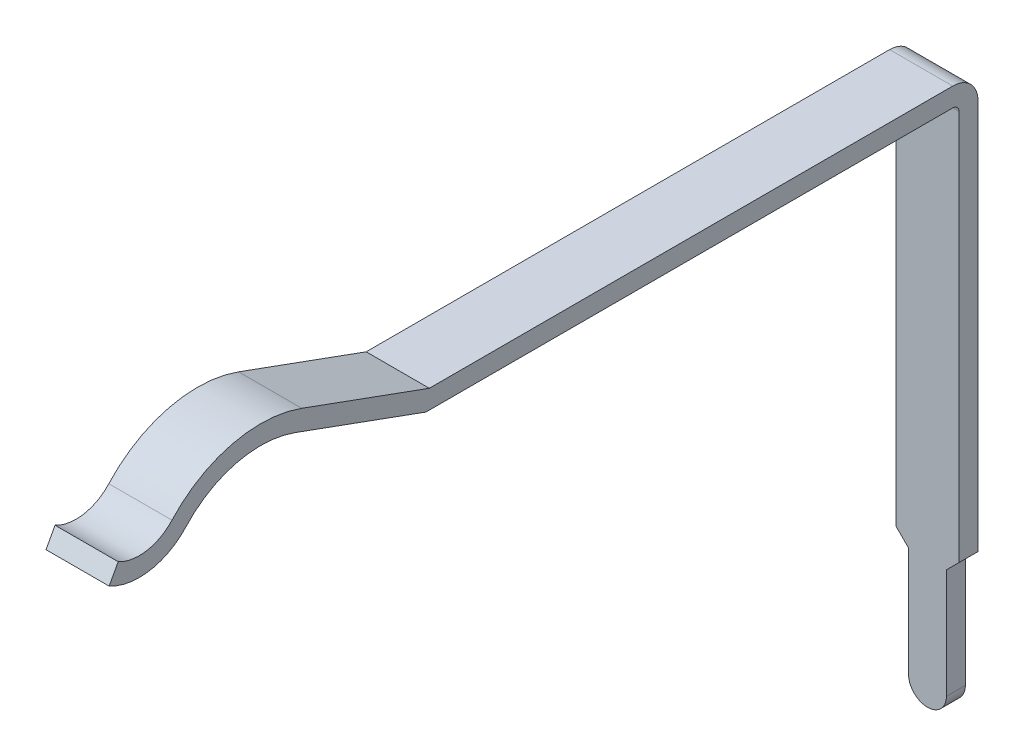
ISO-10303-21;
HEADER;
FILE_DESCRIPTION(('STEP AP214'),'2;1');
FILE_NAME('part.step','',(''),(''),'','','');
FILE_SCHEMA(('AUTOMOTIVE_DESIGN { 1 0 10303 214 1 1 1 1 }'));
ENDSEC;
DATA;
#1=APPLICATION_CONTEXT('core data for automotive mechanical design processes');
#2=APPLICATION_PROTOCOL_DEFINITION('international standard','automotive_design',2000,#1);
#3=PRODUCT_CONTEXT('',#1,'mechanical');
#4=PRODUCT('Part','Part','',(#3));
#5=PRODUCT_RELATED_PRODUCT_CATEGORY('part','',(#4));
#6=PRODUCT_DEFINITION_FORMATION('','',#4);
#7=PRODUCT_DEFINITION_CONTEXT('part definition',#1,'design');
#8=PRODUCT_DEFINITION('design','',#6,#7);
#9=PRODUCT_DEFINITION_SHAPE('','',#8);
#10=(LENGTH_UNIT() NAMED_UNIT(*) SI_UNIT(.MILLI.,.METRE.));
#11=(NAMED_UNIT(*) PLANE_ANGLE_UNIT() SI_UNIT($,.RADIAN.));
#12=(NAMED_UNIT(*) SI_UNIT($,.STERADIAN.) SOLID_ANGLE_UNIT());
#13=UNCERTAINTY_MEASURE_WITH_UNIT(LENGTH_MEASURE(1.E-05),#10,'distance_accuracy_value','');
#14=(GEOMETRIC_REPRESENTATION_CONTEXT(3) GLOBAL_UNCERTAINTY_ASSIGNED_CONTEXT((#13)) GLOBAL_UNIT_ASSIGNED_CONTEXT((#10,
#11,#12)) REPRESENTATION_CONTEXT('',''));
#15=CARTESIAN_POINT('',(0.,0.,0.));
#16=DIRECTION('',(0.,0.,1.));
#17=DIRECTION('',(1.,0.,0.));
#18=AXIS2_PLACEMENT_3D('',#15,#16,#17);
#19=CARTESIAN_POINT('',(0.5,-0.1,-14.46));
#20=DIRECTION('',(0.,0.,-1.));
#21=DIRECTION('',(-1.,0.,0.));
#22=AXIS2_PLACEMENT_3D('',#19,#20,#21);
#23=PLANE('',#22);
#24=DIRECTION('',(0.,1.,0.));
#25=VECTOR('',#24,1.);
#26=CARTESIAN_POINT('',(0.3,-0.1,-14.46));
#27=LINE('',#26,#25);
#28=CARTESIAN_POINT('',(0.3,-8.22,-14.46));
#29=VERTEX_POINT('',#28);
#30=CARTESIAN_POINT('',(0.3,-6.48526500902805,-14.46));
#31=VERTEX_POINT('',#30);
#32=EDGE_CURVE('E259',#29,#31,#27,.T.);
#33=ORIENTED_EDGE('',*,*,#32,.T.);
#34=DIRECTION('',(0.707106781186563,0.707106781186532,0.));
#35=VECTOR('',#34,1.);
#36=CARTESIAN_POINT('',(3.59263250451403,-3.19263250451417,-14.46));
#37=LINE('',#36,#35);
#38=CARTESIAN_POINT('',(0.5,-6.28526500902806,-14.46));
#39=VERTEX_POINT('',#38);
#40=EDGE_CURVE('E254',#31,#39,#37,.T.);
#41=ORIENTED_EDGE('',*,*,#40,.T.);
#42=DIRECTION('',(0.,-1.,0.));
#43=VECTOR('',#42,1.);
#44=CARTESIAN_POINT('',(0.5,-0.1,-14.46));
#45=LINE('',#44,#43);
#46=CARTESIAN_POINT('',(0.5,-0.1,-14.46));
#47=VERTEX_POINT('',#46);
#48=EDGE_CURVE('E182',#47,#39,#45,.T.);
#49=ORIENTED_EDGE('',*,*,#48,.F.);
#50=DIRECTION('',(-1.,0.,0.));
#51=VECTOR('',#50,1.);
#52=CARTESIAN_POINT('',(0.5,-0.1,-14.46));
#53=LINE('',#52,#51);
#54=CARTESIAN_POINT('',(-0.5,-0.1,-14.46));
#55=VERTEX_POINT('',#54);
#56=EDGE_CURVE('E145',#47,#55,#53,.T.);
#57=ORIENTED_EDGE('',*,*,#56,.T.);
#58=DIRECTION('',(0.,-1.,0.));
#59=VECTOR('',#58,1.);
#60=CARTESIAN_POINT('',(-0.5,-0.1,-14.46));
#61=LINE('',#60,#59);
#62=CARTESIAN_POINT('',(-0.5,-6.28526500902805,-14.46));
#63=VERTEX_POINT('',#62);
#64=EDGE_CURVE('E149',#55,#63,#61,.T.);
#65=ORIENTED_EDGE('',*,*,#64,.T.);
#66=DIRECTION('',(0.707106781186542,-0.707106781186553,0.));
#67=VECTOR('',#66,1.);
#68=CARTESIAN_POINT('',(-3.09263250451403,-3.69263250451398,-14.46));
#69=LINE('',#68,#67);
#70=CARTESIAN_POINT('',(-0.3,-6.48526500902805,-14.46));
#71=VERTEX_POINT('',#70);
#72=EDGE_CURVE('E31',#63,#71,#69,.T.);
#73=ORIENTED_EDGE('',*,*,#72,.T.);
#74=DIRECTION('',(0.,-1.,0.));
#75=VECTOR('',#74,1.);
#76=CARTESIAN_POINT('',(-0.3,-0.1,-14.46));
#77=LINE('',#76,#75);
#78=CARTESIAN_POINT('',(-0.3,-8.22,-14.46));
#79=VERTEX_POINT('',#78);
#80=EDGE_CURVE('E261',#71,#79,#77,.T.);
#81=ORIENTED_EDGE('',*,*,#80,.T.);
#82=CARTESIAN_POINT('',(0.,-8.22,-14.46));
#83=DIRECTION('',(0.,0.,-1.));
#84=DIRECTION('',(-1.,0.,0.));
#85=AXIS2_PLACEMENT_3D('',#82,#83,#84);
#86=CIRCLE('',#85,0.3);
#87=EDGE_CURVE('E153',#79,#29,#86,.F.);
#88=ORIENTED_EDGE('',*,*,#87,.T.);
#89=EDGE_LOOP('',(#33,#41,#49,#57,#65,#73,#81,#88));
#90=FACE_BOUND('',#89,.T.);
#91=ADVANCED_FACE('F17',(#90),#23,.F.);
#92=CARTESIAN_POINT('',(0.5,-0.1,-14.76));
#93=DIRECTION('',(0.,0.,-1.));
#94=DIRECTION('',(-1.,0.,0.));
#95=AXIS2_PLACEMENT_3D('',#92,#93,#94);
#96=PLANE('',#95);
#97=DIRECTION('',(-0.707106781186563,-0.707106781186532,0.));
#98=VECTOR('',#97,1.);
#99=CARTESIAN_POINT('',(0.5,-6.28526500902806,-14.76));
#100=LINE('',#99,#98);
#101=CARTESIAN_POINT('',(0.5,-6.28526500902806,-14.76));
#102=VERTEX_POINT('',#101);
#103=CARTESIAN_POINT('',(0.3,-6.48526500902805,-14.76));
#104=VERTEX_POINT('',#103);
#105=EDGE_CURVE('E285',#102,#104,#100,.T.);
#106=ORIENTED_EDGE('',*,*,#105,.T.);
#107=DIRECTION('',(0.,-1.,0.));
#108=VECTOR('',#107,1.);
#109=CARTESIAN_POINT('',(0.3,-6.48526500902805,-14.76));
#110=LINE('',#109,#108);
#111=CARTESIAN_POINT('',(0.3,-8.22,-14.76));
#112=VERTEX_POINT('',#111);
#113=EDGE_CURVE('E271',#104,#112,#110,.T.);
#114=ORIENTED_EDGE('',*,*,#113,.T.);
#115=CARTESIAN_POINT('',(0.,-8.22,-14.76));
#116=DIRECTION('',(0.,0.,-1.));
#117=DIRECTION('',(1.,0.,0.));
#118=AXIS2_PLACEMENT_3D('',#115,#116,#117);
#119=CIRCLE('',#118,0.3);
#120=CARTESIAN_POINT('',(-0.3,-8.22,-14.76));
#121=VERTEX_POINT('',#120);
#122=EDGE_CURVE('E294',#112,#121,#119,.T.);
#123=ORIENTED_EDGE('',*,*,#122,.T.);
#124=DIRECTION('',(0.,1.,0.));
#125=VECTOR('',#124,1.);
#126=CARTESIAN_POINT('',(-0.3,-8.22,-14.76));
#127=LINE('',#126,#125);
#128=CARTESIAN_POINT('',(-0.3,-6.48526500902805,-14.76));
#129=VERTEX_POINT('',#128);
#130=EDGE_CURVE('E291',#121,#129,#127,.T.);
#131=ORIENTED_EDGE('',*,*,#130,.T.);
#132=DIRECTION('',(-0.707106781186542,0.707106781186553,0.));
#133=VECTOR('',#132,1.);
#134=CARTESIAN_POINT('',(-0.3,-6.48526500902805,-14.76));
#135=LINE('',#134,#133);
#136=CARTESIAN_POINT('',(-0.5,-6.28526500902805,-14.76));
#137=VERTEX_POINT('',#136);
#138=EDGE_CURVE('E288',#129,#137,#135,.T.);
#139=ORIENTED_EDGE('',*,*,#138,.T.);
#140=DIRECTION('',(0.,1.,0.));
#141=VECTOR('',#140,1.);
#142=CARTESIAN_POINT('',(-0.5,-0.1,-14.76));
#143=LINE('',#142,#141);
#144=CARTESIAN_POINT('',(-0.5,-0.1,-14.76));
#145=VERTEX_POINT('',#144);
#146=EDGE_CURVE('E152',#145,#137,#143,.F.);
#147=ORIENTED_EDGE('',*,*,#146,.F.);
#148=DIRECTION('',(-1.,0.,0.));
#149=VECTOR('',#148,1.);
#150=CARTESIAN_POINT('',(0.5,-0.1,-14.76));
#151=LINE('',#150,#149);
#152=CARTESIAN_POINT('',(0.5,-0.1,-14.76));
#153=VERTEX_POINT('',#152);
#154=EDGE_CURVE('E11',#153,#145,#151,.T.);
#155=ORIENTED_EDGE('',*,*,#154,.F.);
#156=DIRECTION('',(0.,1.,0.));
#157=VECTOR('',#156,1.);
#158=CARTESIAN_POINT('',(0.5,-0.1,-14.76));
#159=LINE('',#158,#157);
#160=EDGE_CURVE('E224',#153,#102,#159,.F.);
#161=ORIENTED_EDGE('',*,*,#160,.T.);
#162=EDGE_LOOP('',(#106,#114,#123,#131,#139,#147,#155,#161));
#163=FACE_BOUND('',#162,.T.);
#164=ADVANCED_FACE('F298',(#163),#96,.T.);
#165=CARTESIAN_POINT('',(0.5,-0.1,-14.36));
#166=DIRECTION('',(-1.,0.,0.));
#167=DIRECTION('',(0.,0.,1.));
#168=AXIS2_PLACEMENT_3D('',#165,#166,#167);
#169=CYLINDRICAL_SURFACE('',#168,0.4);
#170=CARTESIAN_POINT('',(-0.5,-0.1,-14.36));
#171=DIRECTION('',(1.,0.,0.));
#172=DIRECTION('',(0.,0.,-1.));
#173=AXIS2_PLACEMENT_3D('',#170,#171,#172);
#174=CIRCLE('',#173,0.4);
#175=CARTESIAN_POINT('',(-0.5,0.3,-14.36));
#176=VERTEX_POINT('',#175);
#177=EDGE_CURVE('E156',#176,#145,#174,.F.);
#178=ORIENTED_EDGE('',*,*,#177,.F.);
#179=DIRECTION('',(-1.,0.,0.));
#180=VECTOR('',#179,1.);
#181=CARTESIAN_POINT('',(0.5,0.3,-14.36));
#182=LINE('',#181,#180);
#183=CARTESIAN_POINT('',(0.5,0.3,-14.36));
#184=VERTEX_POINT('',#183);
#185=EDGE_CURVE('E24',#184,#176,#182,.T.);
#186=ORIENTED_EDGE('',*,*,#185,.F.);
#187=CARTESIAN_POINT('',(0.5,-0.1,-14.36));
#188=DIRECTION('',(1.,0.,0.));
#189=DIRECTION('',(0.,0.,-1.));
#190=AXIS2_PLACEMENT_3D('',#187,#188,#189);
#191=CIRCLE('',#190,0.4);
#192=EDGE_CURVE('E220',#184,#153,#191,.F.);
#193=ORIENTED_EDGE('',*,*,#192,.T.);
#194=ORIENTED_EDGE('',*,*,#154,.T.);
#195=EDGE_LOOP('',(#178,#186,#193,#194));
#196=FACE_BOUND('',#195,.T.);
#197=ADVANCED_FACE('F208',(#196),#169,.T.);
#198=CARTESIAN_POINT('',(0.5,0.3,-6.01747897567001));
#199=DIRECTION('',(0.,1.,0.));
#200=DIRECTION('',(0.,0.,1.));
#201=AXIS2_PLACEMENT_3D('',#198,#199,#200);
#202=PLANE('',#201);
#203=DIRECTION('',(0.,0.,-1.));
#204=VECTOR('',#203,1.);
#205=CARTESIAN_POINT('',(-0.5,0.3,-6.01747897567001));
#206=LINE('',#205,#204);
#207=CARTESIAN_POINT('',(-0.5,0.3,-6.07037706988255));
#208=VERTEX_POINT('',#207);
#209=EDGE_CURVE('E159',#208,#176,#206,.T.);
#210=ORIENTED_EDGE('',*,*,#209,.F.);
#211=DIRECTION('',(-1.,0.,0.));
#212=VECTOR('',#211,1.);
#213=CARTESIAN_POINT('',(0.5,0.3,-6.07037706988255));
#214=LINE('',#213,#212);
#215=CARTESIAN_POINT('',(0.5,0.3,-6.07037706988255));
#216=VERTEX_POINT('',#215);
#217=EDGE_CURVE('E197',#216,#208,#214,.T.);
#218=ORIENTED_EDGE('',*,*,#217,.F.);
#219=DIRECTION('',(0.,0.,-1.));
#220=VECTOR('',#219,1.);
#221=CARTESIAN_POINT('',(0.5,0.3,-6.01747897567001));
#222=LINE('',#221,#220);
#223=EDGE_CURVE('E204',#216,#184,#222,.T.);
#224=ORIENTED_EDGE('',*,*,#223,.T.);
#225=ORIENTED_EDGE('',*,*,#185,.T.);
#226=EDGE_LOOP('',(#210,#218,#224,#225));
#227=FACE_BOUND('',#226,.T.);
#228=ADVANCED_FACE('F202',(#227),#202,.T.);
#229=CARTESIAN_POINT('',(0.5,1.03541597949323,-4.04983827231876));
#230=DIRECTION('',(0.,0.93969262078591,-0.342020143325663));
#231=DIRECTION('',(0.,0.342020143325663,0.93969262078591));
#232=AXIS2_PLACEMENT_3D('',#229,#230,#231);
#233=PLANE('',#232);
#234=DIRECTION('',(0.,-0.342020143325663,-0.93969262078591));
#235=VECTOR('',#234,1.);
#236=CARTESIAN_POINT('',(-0.5,1.03541597949323,-4.04983827231876));
#237=LINE('',#236,#235);
#238=CARTESIAN_POINT('',(-0.5,1.03541597949323,-4.04983827231876));
#239=VERTEX_POINT('',#238);
#240=EDGE_CURVE('E162',#239,#208,#237,.T.);
#241=ORIENTED_EDGE('',*,*,#240,.F.);
#242=DIRECTION('',(-1.,0.,0.));
#243=VECTOR('',#242,1.);
#244=CARTESIAN_POINT('',(0.5,1.03541597949323,-4.04983827231876));
#245=LINE('',#244,#243);
#246=CARTESIAN_POINT('',(0.5,1.03541597949323,-4.04983827231876));
#247=VERTEX_POINT('',#246);
#248=EDGE_CURVE('E195',#247,#239,#245,.T.);
#249=ORIENTED_EDGE('',*,*,#248,.F.);
#250=DIRECTION('',(0.,-0.342020143325663,-0.93969262078591));
#251=VECTOR('',#250,1.);
#252=CARTESIAN_POINT('',(0.5,1.03541597949323,-4.04983827231876));
#253=LINE('',#252,#251);
#254=EDGE_CURVE('E217',#247,#216,#253,.T.);
#255=ORIENTED_EDGE('',*,*,#254,.T.);
#256=ORIENTED_EDGE('',*,*,#217,.T.);
#257=EDGE_LOOP('',(#241,#249,#255,#256));
#258=FACE_BOUND('',#257,.T.);
#259=ADVANCED_FACE('F214',(#258),#233,.T.);
#260=CARTESIAN_POINT('',(0.5,-0.75,-3.4));
#261=DIRECTION('',(-1.,0.,0.));
#262=DIRECTION('',(0.,0.,1.));
#263=AXIS2_PLACEMENT_3D('',#260,#261,#262);
#264=CYLINDRICAL_SURFACE('',#263,1.9);
#265=CARTESIAN_POINT('',(-0.5,-0.75,-3.4));
#266=DIRECTION('',(1.,0.,0.));
#267=DIRECTION('',(0.,0.,-1.));
#268=AXIS2_PLACEMENT_3D('',#265,#266,#267);
#269=CIRCLE('',#268,1.9);
#270=CARTESIAN_POINT('',(-0.5,0.528846153846154,-1.99481228485554));
#271=VERTEX_POINT('',#270);
#272=EDGE_CURVE('E165',#271,#239,#269,.F.);
#273=ORIENTED_EDGE('',*,*,#272,.F.);
#274=DIRECTION('',(-1.,0.,0.));
#275=VECTOR('',#274,1.);
#276=CARTESIAN_POINT('',(0.5,0.528846153846154,-1.99481228485554));
#277=LINE('',#276,#275);
#278=CARTESIAN_POINT('',(0.5,0.528846153846154,-1.99481228485554));
#279=VERTEX_POINT('',#278);
#280=EDGE_CURVE('E193',#279,#271,#277,.T.);
#281=ORIENTED_EDGE('',*,*,#280,.F.);
#282=CARTESIAN_POINT('',(0.5,-0.75,-3.4));
#283=DIRECTION('',(1.,0.,0.));
#284=DIRECTION('',(0.,0.,-1.));
#285=AXIS2_PLACEMENT_3D('',#282,#283,#284);
#286=CIRCLE('',#285,1.9);
#287=EDGE_CURVE('E222',#279,#247,#286,.F.);
#288=ORIENTED_EDGE('',*,*,#287,.T.);
#289=ORIENTED_EDGE('',*,*,#248,.T.);
#290=EDGE_LOOP('',(#273,#281,#288,#289));
#291=FACE_BOUND('',#290,.T.);
#292=ADVANCED_FACE('F357',(#291),#264,.T.);
#293=CARTESIAN_POINT('',(0.5,1.,-1.47711154769706));
#294=DIRECTION('',(-1.,0.,0.));
#295=DIRECTION('',(0.,0.,1.));
#296=AXIS2_PLACEMENT_3D('',#293,#294,#295);
#297=CYLINDRICAL_SURFACE('',#296,0.7);
#298=CARTESIAN_POINT('',(-0.5,1.,-1.47711154769706));
#299=DIRECTION('',(1.,0.,0.));
#300=DIRECTION('',(0.,0.,-1.));
#301=AXIS2_PLACEMENT_3D('',#298,#299,#300);
#302=CIRCLE('',#301,0.7);
#303=CARTESIAN_POINT('',(-0.5,0.384810078255083,-1.14313346430912));
#304=VERTEX_POINT('',#303);
#305=EDGE_CURVE('E168',#304,#271,#302,.T.);
#306=ORIENTED_EDGE('',*,*,#305,.F.);
#307=DIRECTION('',(-1.,0.,0.));
#308=VECTOR('',#307,1.);
#309=CARTESIAN_POINT('',(0.5,0.384810078255083,-1.14313346430912));
#310=LINE('',#309,#308);
#311=CARTESIAN_POINT('',(0.5,0.384810078255083,-1.14313346430912));
#312=VERTEX_POINT('',#311);
#313=EDGE_CURVE('E191',#312,#304,#310,.T.);
#314=ORIENTED_EDGE('',*,*,#313,.F.);
#315=CARTESIAN_POINT('',(0.5,1.,-1.47711154769706));
#316=DIRECTION('',(1.,0.,0.));
#317=DIRECTION('',(0.,0.,-1.));
#318=AXIS2_PLACEMENT_3D('',#315,#316,#317);
#319=CIRCLE('',#318,0.7);
#320=EDGE_CURVE('E229',#312,#279,#319,.T.);
#321=ORIENTED_EDGE('',*,*,#320,.T.);
#322=ORIENTED_EDGE('',*,*,#280,.T.);
#323=EDGE_LOOP('',(#306,#314,#321,#322));
#324=FACE_BOUND('',#323,.T.);
#325=ADVANCED_FACE('F360',(#324),#297,.F.);
#326=CARTESIAN_POINT('',(0.5,0.121157254650118,-1.));
#327=DIRECTION('',(0.,0.477111547697058,0.878842745349882));
#328=DIRECTION('',(0.,-0.878842745349883,0.477111547697058));
#329=AXIS2_PLACEMENT_3D('',#326,#327,#328);
#330=PLANE('',#329);
#331=DIRECTION('',(0.,0.878842745349882,-0.477111547697058));
#332=VECTOR('',#331,1.);
#333=CARTESIAN_POINT('',(-0.5,0.121157254650118,-1.));
#334=LINE('',#333,#332);
#335=CARTESIAN_POINT('',(-0.5,0.121157254650118,-1.));
#336=VERTEX_POINT('',#335);
#337=EDGE_CURVE('E171',#336,#304,#334,.T.);
#338=ORIENTED_EDGE('',*,*,#337,.F.);
#339=DIRECTION('',(-1.,0.,0.));
#340=VECTOR('',#339,1.);
#341=CARTESIAN_POINT('',(0.5,0.121157254650118,-1.));
#342=LINE('',#341,#340);
#343=CARTESIAN_POINT('',(0.5,0.121157254650118,-1.));
#344=VERTEX_POINT('',#343);
#345=EDGE_CURVE('E189',#344,#336,#342,.T.);
#346=ORIENTED_EDGE('',*,*,#345,.F.);
#347=DIRECTION('',(0.,0.878842745349882,-0.477111547697058));
#348=VECTOR('',#347,1.);
#349=CARTESIAN_POINT('',(0.5,0.121157254650118,-1.));
#350=LINE('',#349,#348);
#351=EDGE_CURVE('E232',#344,#312,#350,.T.);
#352=ORIENTED_EDGE('',*,*,#351,.T.);
#353=ORIENTED_EDGE('',*,*,#313,.T.);
#354=EDGE_LOOP('',(#338,#346,#352,#353));
#355=FACE_BOUND('',#354,.T.);
#356=ADVANCED_FACE('F364',(#355),#330,.T.);
#357=CARTESIAN_POINT('',(0.5,1.,-1.47711154769706));
#358=DIRECTION('',(-1.,0.,0.));
#359=DIRECTION('',(0.,0.,1.));
#360=AXIS2_PLACEMENT_3D('',#357,#358,#359);
#361=CYLINDRICAL_SURFACE('',#360,1.);
#362=CARTESIAN_POINT('',(-0.5,1.,-1.47711154769706));
#363=DIRECTION('',(1.,0.,0.));
#364=DIRECTION('',(0.,0.,1.));
#365=AXIS2_PLACEMENT_3D('',#362,#363,#364);
#366=CIRCLE('',#365,1.);
#367=CARTESIAN_POINT('',(-0.5,0.326923076923077,-2.21668402935204));
#368=VERTEX_POINT('',#367);
#369=EDGE_CURVE('E174',#336,#368,#366,.T.);
#370=ORIENTED_EDGE('',*,*,#369,.T.);
#371=DIRECTION('',(-1.,0.,0.));
#372=VECTOR('',#371,1.);
#373=CARTESIAN_POINT('',(0.5,0.326923076923077,-2.21668402935204));
#374=LINE('',#373,#372);
#375=CARTESIAN_POINT('',(0.5,0.326923076923077,-2.21668402935204));
#376=VERTEX_POINT('',#375);
#377=EDGE_CURVE('E186',#376,#368,#374,.T.);
#378=ORIENTED_EDGE('',*,*,#377,.F.);
#379=CARTESIAN_POINT('',(0.5,1.,-1.47711154769706));
#380=DIRECTION('',(1.,0.,0.));
#381=DIRECTION('',(0.,0.,1.));
#382=AXIS2_PLACEMENT_3D('',#379,#380,#381);
#383=CIRCLE('',#382,1.);
#384=EDGE_CURVE('E235',#344,#376,#383,.T.);
#385=ORIENTED_EDGE('',*,*,#384,.F.);
#386=ORIENTED_EDGE('',*,*,#345,.T.);
#387=EDGE_LOOP('',(#370,#378,#385,#386));
#388=FACE_BOUND('',#387,.T.);
#389=ADVANCED_FACE('F241',(#388),#361,.T.);
#390=CARTESIAN_POINT('',(0.5,-0.75,-3.4));
#391=DIRECTION('',(-1.,0.,0.));
#392=DIRECTION('',(0.,0.,1.));
#393=AXIS2_PLACEMENT_3D('',#390,#391,#392);
#394=CYLINDRICAL_SURFACE('',#393,1.6);
#395=CARTESIAN_POINT('',(-0.5,-0.75,-3.4));
#396=DIRECTION('',(-1.,0.,0.));
#397=DIRECTION('',(0.,0.,-1.));
#398=AXIS2_PLACEMENT_3D('',#395,#396,#397);
#399=CIRCLE('',#398,1.6);
#400=CARTESIAN_POINT('',(-0.5,0.753508193257457,-3.94723222932106));
#401=VERTEX_POINT('',#400);
#402=EDGE_CURVE('E176',#368,#401,#399,.T.);
#403=ORIENTED_EDGE('',*,*,#402,.T.);
#404=DIRECTION('',(-1.,0.,0.));
#405=VECTOR('',#404,1.);
#406=CARTESIAN_POINT('',(0.5,0.753508193257457,-3.94723222932106));
#407=LINE('',#406,#405);
#408=CARTESIAN_POINT('',(0.5,0.753508193257457,-3.94723222932106));
#409=VERTEX_POINT('',#408);
#410=EDGE_CURVE('E140',#409,#401,#407,.T.);
#411=ORIENTED_EDGE('',*,*,#410,.F.);
#412=CARTESIAN_POINT('',(0.5,-0.75,-3.4));
#413=DIRECTION('',(-1.,0.,0.));
#414=DIRECTION('',(0.,0.,-1.));
#415=AXIS2_PLACEMENT_3D('',#412,#413,#414);
#416=CIRCLE('',#415,1.6);
#417=EDGE_CURVE('E128',#376,#409,#416,.T.);
#418=ORIENTED_EDGE('',*,*,#417,.F.);
#419=ORIENTED_EDGE('',*,*,#377,.T.);
#420=EDGE_LOOP('',(#403,#411,#418,#419));
#421=FACE_BOUND('',#420,.T.);
#422=ADVANCED_FACE('F245',(#421),#394,.F.);
#423=CARTESIAN_POINT('',(0.5,0.753508193257457,-3.94723222932106));
#424=DIRECTION('',(0.,0.93969262078591,-0.342020143325663));
#425=DIRECTION('',(0.,0.342020143325663,0.93969262078591));
#426=AXIS2_PLACEMENT_3D('',#423,#424,#425);
#427=PLANE('',#426);
#428=DIRECTION('',(0.,-0.342020143325663,-0.93969262078591));
#429=VECTOR('',#428,1.);
#430=CARTESIAN_POINT('',(-0.5,0.753508193257457,-3.94723222932106));
#431=LINE('',#430,#429);
#432=CARTESIAN_POINT('',(-0.5,0.,-6.01747897567001));
#433=VERTEX_POINT('',#432);
#434=EDGE_CURVE('E137',#401,#433,#431,.T.);
#435=ORIENTED_EDGE('',*,*,#434,.T.);
#436=DIRECTION('',(-1.,0.,0.));
#437=VECTOR('',#436,1.);
#438=CARTESIAN_POINT('',(0.5,0.,-6.01747897567001));
#439=LINE('',#438,#437);
#440=CARTESIAN_POINT('',(0.5,0.,-6.01747897567001));
#441=VERTEX_POINT('',#440);
#442=EDGE_CURVE('E134',#441,#433,#439,.T.);
#443=ORIENTED_EDGE('',*,*,#442,.F.);
#444=DIRECTION('',(0.,-0.342020143325663,-0.93969262078591));
#445=VECTOR('',#444,1.);
#446=CARTESIAN_POINT('',(0.5,0.753508193257457,-3.94723222932106));
#447=LINE('',#446,#445);
#448=EDGE_CURVE('E120',#409,#441,#447,.T.);
#449=ORIENTED_EDGE('',*,*,#448,.F.);
#450=ORIENTED_EDGE('',*,*,#410,.T.);
#451=EDGE_LOOP('',(#435,#443,#449,#450));
#452=FACE_BOUND('',#451,.T.);
#453=ADVANCED_FACE('F135',(#452),#427,.F.);
#454=CARTESIAN_POINT('',(0.5,0.,-6.01747897567001));
#455=DIRECTION('',(0.,1.,0.));
#456=DIRECTION('',(0.,0.,1.));
#457=AXIS2_PLACEMENT_3D('',#454,#455,#456);
#458=PLANE('',#457);
#459=DIRECTION('',(0.,0.,-1.));
#460=VECTOR('',#459,1.);
#461=CARTESIAN_POINT('',(-0.5,0.,-6.01747897567001));
#462=LINE('',#461,#460);
#463=CARTESIAN_POINT('',(-0.5,0.,-14.36));
#464=VERTEX_POINT('',#463);
#465=EDGE_CURVE('E179',#433,#464,#462,.T.);
#466=ORIENTED_EDGE('',*,*,#465,.T.);
#467=DIRECTION('',(-1.,0.,0.));
#468=VECTOR('',#467,1.);
#469=CARTESIAN_POINT('',(0.5,0.,-14.36));
#470=LINE('',#469,#468);
#471=CARTESIAN_POINT('',(0.5,0.,-14.36));
#472=VERTEX_POINT('',#471);
#473=EDGE_CURVE('E141',#472,#464,#470,.T.);
#474=ORIENTED_EDGE('',*,*,#473,.F.);
#475=DIRECTION('',(0.,0.,-1.));
#476=VECTOR('',#475,1.);
#477=CARTESIAN_POINT('',(0.5,0.,-6.01747897567001));
#478=LINE('',#477,#476);
#479=EDGE_CURVE('E125',#441,#472,#478,.T.);
#480=ORIENTED_EDGE('',*,*,#479,.F.);
#481=ORIENTED_EDGE('',*,*,#442,.T.);
#482=EDGE_LOOP('',(#466,#474,#480,#481));
#483=FACE_BOUND('',#482,.T.);
#484=ADVANCED_FACE('F143',(#483),#458,.F.);
#485=CARTESIAN_POINT('',(0.5,-0.1,-14.36));
#486=DIRECTION('',(-1.,0.,0.));
#487=DIRECTION('',(0.,0.,1.));
#488=AXIS2_PLACEMENT_3D('',#485,#486,#487);
#489=CYLINDRICAL_SURFACE('',#488,0.1);
#490=CARTESIAN_POINT('',(-0.5,-0.1,-14.36));
#491=DIRECTION('',(-1.,0.,0.));
#492=DIRECTION('',(0.,0.,1.));
#493=AXIS2_PLACEMENT_3D('',#490,#491,#492);
#494=CIRCLE('',#493,0.1);
#495=EDGE_CURVE('E84',#464,#55,#494,.T.);
#496=ORIENTED_EDGE('',*,*,#495,.T.);
#497=ORIENTED_EDGE('',*,*,#56,.F.);
#498=CARTESIAN_POINT('',(0.5,-0.1,-14.36));
#499=DIRECTION('',(-1.,0.,0.));
#500=DIRECTION('',(0.,0.,1.));
#501=AXIS2_PLACEMENT_3D('',#498,#499,#500);
#502=CIRCLE('',#501,0.1);
#503=EDGE_CURVE('E40',#472,#47,#502,.T.);
#504=ORIENTED_EDGE('',*,*,#503,.F.);
#505=ORIENTED_EDGE('',*,*,#473,.T.);
#506=EDGE_LOOP('',(#496,#497,#504,#505));
#507=FACE_BOUND('',#506,.T.);
#508=ADVANCED_FACE('F247',(#507),#489,.F.);
#509=CARTESIAN_POINT('',(0.5,-0.1,-14.36));
#510=DIRECTION('',(1.,0.,0.));
#511=DIRECTION('',(0.,0.,-1.));
#512=AXIS2_PLACEMENT_3D('',#509,#510,#511);
#513=PLANE('',#512);
#514=DIRECTION('',(0.,0.,1.));
#515=VECTOR('',#514,1.);
#516=CARTESIAN_POINT('',(0.5,-6.28526500902806,-14.76));
#517=LINE('',#516,#515);
#518=EDGE_CURVE('E275',#102,#39,#517,.T.);
#519=ORIENTED_EDGE('',*,*,#518,.F.);
#520=ORIENTED_EDGE('',*,*,#160,.F.);
#521=ORIENTED_EDGE('',*,*,#192,.F.);
#522=ORIENTED_EDGE('',*,*,#223,.F.);
#523=ORIENTED_EDGE('',*,*,#254,.F.);
#524=ORIENTED_EDGE('',*,*,#287,.F.);
#525=ORIENTED_EDGE('',*,*,#320,.F.);
#526=ORIENTED_EDGE('',*,*,#351,.F.);
#527=ORIENTED_EDGE('',*,*,#384,.T.);
#528=ORIENTED_EDGE('',*,*,#417,.T.);
#529=ORIENTED_EDGE('',*,*,#448,.T.);
#530=ORIENTED_EDGE('',*,*,#479,.T.);
#531=ORIENTED_EDGE('',*,*,#503,.T.);
#532=ORIENTED_EDGE('',*,*,#48,.T.);
#533=EDGE_LOOP('',(#519,#520,#521,#522,#523,#524,#525,#526,#527,#528,#529,#530,#531,#532));
#534=FACE_BOUND('',#533,.T.);
#535=ADVANCED_FACE('F123',(#534),#513,.T.);
#536=CARTESIAN_POINT('',(-0.5,-0.1,-14.36));
#537=DIRECTION('',(1.,0.,0.));
#538=DIRECTION('',(0.,0.,-1.));
#539=AXIS2_PLACEMENT_3D('',#536,#537,#538);
#540=PLANE('',#539);
#541=ORIENTED_EDGE('',*,*,#146,.T.);
#542=DIRECTION('',(0.,0.,1.));
#543=VECTOR('',#542,1.);
#544=CARTESIAN_POINT('',(-0.5,-6.28526500902805,-14.76));
#545=LINE('',#544,#543);
#546=EDGE_CURVE('E273',#137,#63,#545,.T.);
#547=ORIENTED_EDGE('',*,*,#546,.T.);
#548=ORIENTED_EDGE('',*,*,#64,.F.);
#549=ORIENTED_EDGE('',*,*,#495,.F.);
#550=ORIENTED_EDGE('',*,*,#465,.F.);
#551=ORIENTED_EDGE('',*,*,#434,.F.);
#552=ORIENTED_EDGE('',*,*,#402,.F.);
#553=ORIENTED_EDGE('',*,*,#369,.F.);
#554=ORIENTED_EDGE('',*,*,#337,.T.);
#555=ORIENTED_EDGE('',*,*,#305,.T.);
#556=ORIENTED_EDGE('',*,*,#272,.T.);
#557=ORIENTED_EDGE('',*,*,#240,.T.);
#558=ORIENTED_EDGE('',*,*,#209,.T.);
#559=ORIENTED_EDGE('',*,*,#177,.T.);
#560=EDGE_LOOP('',(#541,#547,#548,#549,#550,#551,#552,#553,#554,#555,#556,#557,#558,#559));
#561=FACE_BOUND('',#560,.T.);
#562=ADVANCED_FACE('F210',(#561),#540,.F.);
#563=CARTESIAN_POINT('',(0.,-8.22,-14.76));
#564=DIRECTION('',(0.,0.,1.));
#565=DIRECTION('',(1.,0.,0.));
#566=AXIS2_PLACEMENT_3D('',#563,#564,#565);
#567=CYLINDRICAL_SURFACE('',#566,0.3);
#568=DIRECTION('',(0.,0.,1.));
#569=VECTOR('',#568,1.);
#570=CARTESIAN_POINT('',(-0.3,-8.22,-14.76));
#571=LINE('',#570,#569);
#572=EDGE_CURVE('E267',#121,#79,#571,.T.);
#573=ORIENTED_EDGE('',*,*,#572,.F.);
#574=ORIENTED_EDGE('',*,*,#122,.F.);
#575=DIRECTION('',(0.,0.,1.));
#576=VECTOR('',#575,1.);
#577=CARTESIAN_POINT('',(0.3,-8.22,-14.76));
#578=LINE('',#577,#576);
#579=EDGE_CURVE('E266',#112,#29,#578,.T.);
#580=ORIENTED_EDGE('',*,*,#579,.T.);
#581=ORIENTED_EDGE('',*,*,#87,.F.);
#582=EDGE_LOOP('',(#573,#574,#580,#581));
#583=FACE_BOUND('',#582,.T.);
#584=ADVANCED_FACE('F307',(#583),#567,.T.);
#585=CARTESIAN_POINT('',(0.3,-6.48526500902805,-14.76));
#586=DIRECTION('',(-1.,0.,0.));
#587=DIRECTION('',(0.,-1.,0.));
#588=AXIS2_PLACEMENT_3D('',#585,#586,#587);
#589=PLANE('',#588);
#590=ORIENTED_EDGE('',*,*,#579,.F.);
#591=ORIENTED_EDGE('',*,*,#113,.F.);
#592=DIRECTION('',(0.,0.,1.));
#593=VECTOR('',#592,1.);
#594=CARTESIAN_POINT('',(0.3,-6.48526500902805,-14.76));
#595=LINE('',#594,#593);
#596=EDGE_CURVE('E278',#104,#31,#595,.T.);
#597=ORIENTED_EDGE('',*,*,#596,.T.);
#598=ORIENTED_EDGE('',*,*,#32,.F.);
#599=EDGE_LOOP('',(#590,#591,#597,#598));
#600=FACE_BOUND('',#599,.T.);
#601=ADVANCED_FACE('F314',(#600),#589,.F.);
#602=CARTESIAN_POINT('',(-0.3,-8.22,-14.76));
#603=DIRECTION('',(1.,0.,0.));
#604=DIRECTION('',(0.,0.,-1.));
#605=AXIS2_PLACEMENT_3D('',#602,#603,#604);
#606=PLANE('',#605);
#607=DIRECTION('',(0.,0.,1.));
#608=VECTOR('',#607,1.);
#609=CARTESIAN_POINT('',(-0.3,-6.48526500902805,-14.76));
#610=LINE('',#609,#608);
#611=EDGE_CURVE('E270',#129,#71,#610,.T.);
#612=ORIENTED_EDGE('',*,*,#611,.F.);
#613=ORIENTED_EDGE('',*,*,#130,.F.);
#614=ORIENTED_EDGE('',*,*,#572,.T.);
#615=ORIENTED_EDGE('',*,*,#80,.F.);
#616=EDGE_LOOP('',(#612,#613,#614,#615));
#617=FACE_BOUND('',#616,.T.);
#618=ADVANCED_FACE('F333',(#617),#606,.F.);
#619=CARTESIAN_POINT('',(0.5,-6.28526500902806,-14.76));
#620=DIRECTION('',(-0.707106781186532,0.707106781186563,0.));
#621=DIRECTION('',(-0.707106781186563,-0.707106781186532,0.));
#622=AXIS2_PLACEMENT_3D('',#619,#620,#621);
#623=PLANE('',#622);
#624=ORIENTED_EDGE('',*,*,#596,.F.);
#625=ORIENTED_EDGE('',*,*,#105,.F.);
#626=ORIENTED_EDGE('',*,*,#518,.T.);
#627=ORIENTED_EDGE('',*,*,#40,.F.);
#628=EDGE_LOOP('',(#624,#625,#626,#627));
#629=FACE_BOUND('',#628,.T.);
#630=ADVANCED_FACE('F336',(#629),#623,.F.);
#631=CARTESIAN_POINT('',(-0.3,-6.48526500902805,-14.76));
#632=DIRECTION('',(0.707106781186553,0.707106781186542,0.));
#633=DIRECTION('',(-0.707106781186542,0.707106781186553,0.));
#634=AXIS2_PLACEMENT_3D('',#631,#632,#633);
#635=PLANE('',#634);
#636=ORIENTED_EDGE('',*,*,#546,.F.);
#637=ORIENTED_EDGE('',*,*,#138,.F.);
#638=ORIENTED_EDGE('',*,*,#611,.T.);
#639=ORIENTED_EDGE('',*,*,#72,.F.);
#640=EDGE_LOOP('',(#636,#637,#638,#639));
#641=FACE_BOUND('',#640,.T.);
#642=ADVANCED_FACE('F334',(#641),#635,.F.);
#643=CLOSED_SHELL('',(#91,#164,#197,#228,#259,#292,#325,#356,#389,#422,#453,#484,#508,#535,#562,
#584,#601,#618,#630,#642));
#644=MANIFOLD_SOLID_BREP('B1',#643);
#645=ADVANCED_BREP_SHAPE_REPRESENTATION('',(#18,#644),#14);
#646=SHAPE_DEFINITION_REPRESENTATION(#9,#645);
ENDSEC;
END-ISO-10303-21;
